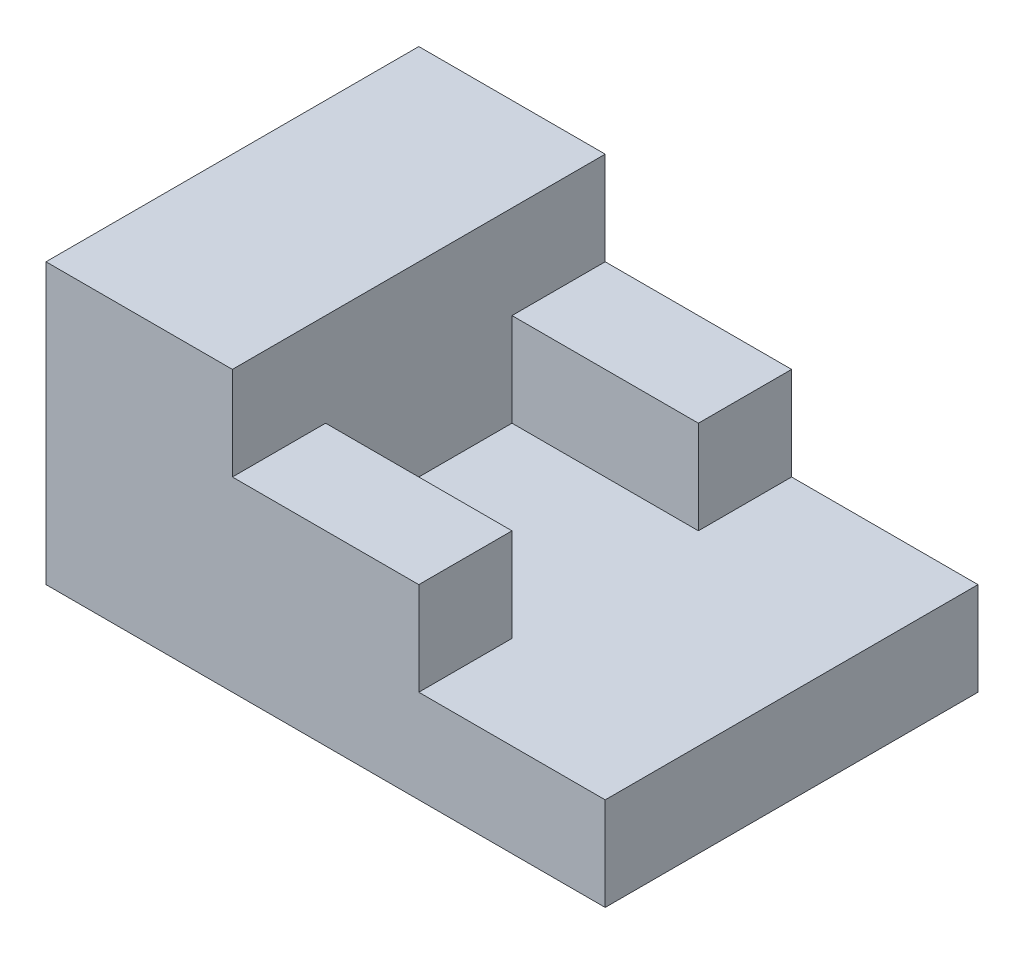
ISO-10303-21;
HEADER;
FILE_DESCRIPTION(('STEP AP214'),'2;1');
FILE_NAME('part.step','',(''),(''),'','','');
FILE_SCHEMA(('AUTOMOTIVE_DESIGN { 1 0 10303 214 1 1 1 1 }'));
ENDSEC;
DATA;
#1=APPLICATION_CONTEXT('core data for automotive mechanical design processes');
#2=APPLICATION_PROTOCOL_DEFINITION('international standard','automotive_design',2000,#1);
#3=PRODUCT_CONTEXT('',#1,'mechanical');
#4=PRODUCT('Part','Part','',(#3));
#5=PRODUCT_RELATED_PRODUCT_CATEGORY('part','',(#4));
#6=PRODUCT_DEFINITION_FORMATION('','',#4);
#7=PRODUCT_DEFINITION_CONTEXT('part definition',#1,'design');
#8=PRODUCT_DEFINITION('design','',#6,#7);
#9=PRODUCT_DEFINITION_SHAPE('','',#8);
#10=(LENGTH_UNIT() NAMED_UNIT(*) SI_UNIT(.MILLI.,.METRE.));
#11=(NAMED_UNIT(*) PLANE_ANGLE_UNIT() SI_UNIT($,.RADIAN.));
#12=(NAMED_UNIT(*) SI_UNIT($,.STERADIAN.) SOLID_ANGLE_UNIT());
#13=UNCERTAINTY_MEASURE_WITH_UNIT(LENGTH_MEASURE(1.E-05),#10,'distance_accuracy_value','');
#14=(GEOMETRIC_REPRESENTATION_CONTEXT(3) GLOBAL_UNCERTAINTY_ASSIGNED_CONTEXT((#13)) GLOBAL_UNIT_ASSIGNED_CONTEXT((#10,
#11,#12)) REPRESENTATION_CONTEXT('',''));
#15=CARTESIAN_POINT('',(0.,0.,0.));
#16=DIRECTION('',(0.,0.,1.));
#17=DIRECTION('',(1.,0.,0.));
#18=AXIS2_PLACEMENT_3D('',#15,#16,#17);
#19=CARTESIAN_POINT('',(-2.90909090909091,6.54545454545455,0.));
#20=DIRECTION('',(0.,1.,0.));
#21=DIRECTION('',(0.,0.,1.));
#22=AXIS2_PLACEMENT_3D('',#19,#20,#21);
#23=PLANE('',#22);
#24=DIRECTION('',(0.,0.,-1.));
#25=VECTOR('',#24,1.);
#26=CARTESIAN_POINT('',(-3.90909090909091,6.54545454545455,0.));
#27=LINE('',#26,#25);
#28=CARTESIAN_POINT('',(-3.90909090909091,6.54545454545455,2.));
#29=VERTEX_POINT('',#28);
#30=CARTESIAN_POINT('',(-3.90909090909091,6.54545454545455,1.));
#31=VERTEX_POINT('',#30);
#32=EDGE_CURVE('E11',#29,#31,#27,.T.);
#33=ORIENTED_EDGE('',*,*,#32,.F.);
#34=DIRECTION('',(1.,0.,0.));
#35=VECTOR('',#34,1.);
#36=CARTESIAN_POINT('',(-2.90909090909091,6.54545454545455,2.));
#37=LINE('',#36,#35);
#38=CARTESIAN_POINT('',(-1.90909090909091,6.54545454545455,2.));
#39=VERTEX_POINT('',#38);
#40=EDGE_CURVE('E168',#29,#39,#37,.T.);
#41=ORIENTED_EDGE('',*,*,#40,.T.);
#42=DIRECTION('',(0.,0.,1.));
#43=VECTOR('',#42,1.);
#44=CARTESIAN_POINT('',(-1.90909090909091,6.54545454545455,0.));
#45=LINE('',#44,#43);
#46=CARTESIAN_POINT('',(-1.90909090909091,6.54545454545455,1.));
#47=VERTEX_POINT('',#46);
#48=EDGE_CURVE('E170',#47,#39,#45,.T.);
#49=ORIENTED_EDGE('',*,*,#48,.F.);
#50=DIRECTION('',(1.,0.,0.));
#51=VECTOR('',#50,1.);
#52=CARTESIAN_POINT('',(-2.90909090909091,6.54545454545455,1.));
#53=LINE('',#52,#51);
#54=EDGE_CURVE('E173',#31,#47,#53,.T.);
#55=ORIENTED_EDGE('',*,*,#54,.F.);
#56=EDGE_LOOP('',(#33,#41,#49,#55));
#57=FACE_BOUND('',#56,.T.);
#58=ADVANCED_FACE('F38',(#57),#23,.T.);
#59=CARTESIAN_POINT('',(-2.90909090909091,5.54545454545455,0.));
#60=DIRECTION('',(0.,1.,0.));
#61=DIRECTION('',(0.,0.,1.));
#62=AXIS2_PLACEMENT_3D('',#59,#60,#61);
#63=PLANE('',#62);
#64=DIRECTION('',(1.,0.,0.));
#65=VECTOR('',#64,1.);
#66=CARTESIAN_POINT('',(-2.90909090909091,5.54545454545455,-2.));
#67=LINE('',#66,#65);
#68=CARTESIAN_POINT('',(-1.90909090909091,5.54545454545455,-2.));
#69=VERTEX_POINT('',#68);
#70=CARTESIAN_POINT('',(0.0909090909090894,5.54545454545455,-2.));
#71=VERTEX_POINT('',#70);
#72=EDGE_CURVE('E139',#69,#71,#67,.T.);
#73=ORIENTED_EDGE('',*,*,#72,.F.);
#74=DIRECTION('',(0.,0.,1.));
#75=VECTOR('',#74,1.);
#76=CARTESIAN_POINT('',(-1.90909090909091,5.54545454545455,0.));
#77=LINE('',#76,#75);
#78=CARTESIAN_POINT('',(-1.90909090909091,5.54545454545455,-1.));
#79=VERTEX_POINT('',#78);
#80=EDGE_CURVE('E59',#69,#79,#77,.T.);
#81=ORIENTED_EDGE('',*,*,#80,.T.);
#82=DIRECTION('',(-1.,0.,0.));
#83=VECTOR('',#82,1.);
#84=CARTESIAN_POINT('',(-2.90909090909091,5.54545454545455,-1.));
#85=LINE('',#84,#83);
#86=CARTESIAN_POINT('',(-3.90909090909091,5.54545454545455,-1.));
#87=VERTEX_POINT('',#86);
#88=EDGE_CURVE('E204',#79,#87,#85,.T.);
#89=ORIENTED_EDGE('',*,*,#88,.T.);
#90=DIRECTION('',(0.,0.,-1.));
#91=VECTOR('',#90,1.);
#92=CARTESIAN_POINT('',(-3.90909090909091,5.54545454545455,0.));
#93=LINE('',#92,#91);
#94=CARTESIAN_POINT('',(-3.90909090909091,5.54545454545455,1.));
#95=VERTEX_POINT('',#94);
#96=EDGE_CURVE('E194',#95,#87,#93,.T.);
#97=ORIENTED_EDGE('',*,*,#96,.F.);
#98=DIRECTION('',(-1.,0.,0.));
#99=VECTOR('',#98,1.);
#100=CARTESIAN_POINT('',(-2.90909090909091,5.54545454545455,1.));
#101=LINE('',#100,#99);
#102=CARTESIAN_POINT('',(-1.90909090909091,5.54545454545455,1.));
#103=VERTEX_POINT('',#102);
#104=EDGE_CURVE('E197',#103,#95,#101,.T.);
#105=ORIENTED_EDGE('',*,*,#104,.F.);
#106=DIRECTION('',(0.,0.,-1.));
#107=VECTOR('',#106,1.);
#108=CARTESIAN_POINT('',(-1.90909090909091,5.54545454545455,0.));
#109=LINE('',#108,#107);
#110=CARTESIAN_POINT('',(-1.90909090909091,5.54545454545455,2.));
#111=VERTEX_POINT('',#110);
#112=EDGE_CURVE('E200',#111,#103,#109,.T.);
#113=ORIENTED_EDGE('',*,*,#112,.F.);
#114=DIRECTION('',(1.,0.,0.));
#115=VECTOR('',#114,1.);
#116=CARTESIAN_POINT('',(-2.90909090909091,5.54545454545455,2.));
#117=LINE('',#116,#115);
#118=CARTESIAN_POINT('',(0.0909090909090894,5.54545454545455,2.));
#119=VERTEX_POINT('',#118);
#120=EDGE_CURVE('E207',#111,#119,#117,.T.);
#121=ORIENTED_EDGE('',*,*,#120,.T.);
#122=DIRECTION('',(0.,0.,-1.));
#123=VECTOR('',#122,1.);
#124=CARTESIAN_POINT('',(0.0909090909090894,5.54545454545455,0.));
#125=LINE('',#124,#123);
#126=EDGE_CURVE('E209',#119,#71,#125,.T.);
#127=ORIENTED_EDGE('',*,*,#126,.T.);
#128=EDGE_LOOP('',(#73,#81,#89,#97,#105,#113,#121,#127));
#129=FACE_BOUND('',#128,.T.);
#130=ADVANCED_FACE('F238',(#129),#63,.T.);
#131=CARTESIAN_POINT('',(-5.90909090909091,5.54545454545455,0.));
#132=DIRECTION('',(-1.,0.,0.));
#133=DIRECTION('',(0.,0.,1.));
#134=AXIS2_PLACEMENT_3D('',#131,#132,#133);
#135=PLANE('',#134);
#136=DIRECTION('',(0.,0.,-1.));
#137=VECTOR('',#136,1.);
#138=CARTESIAN_POINT('',(-5.90909090909091,4.54545454545455,0.));
#139=LINE('',#138,#137);
#140=CARTESIAN_POINT('',(-5.90909090909091,4.54545454545455,2.));
#141=VERTEX_POINT('',#140);
#142=CARTESIAN_POINT('',(-5.90909090909091,4.54545454545455,-2.));
#143=VERTEX_POINT('',#142);
#144=EDGE_CURVE('E206',#141,#143,#139,.T.);
#145=ORIENTED_EDGE('',*,*,#144,.F.);
#146=DIRECTION('',(0.,-1.,0.));
#147=VECTOR('',#146,1.);
#148=CARTESIAN_POINT('',(-5.90909090909091,5.54545454545455,2.));
#149=LINE('',#148,#147);
#150=CARTESIAN_POINT('',(-5.90909090909091,7.54545454545455,2.));
#151=VERTEX_POINT('',#150);
#152=EDGE_CURVE('E148',#151,#141,#149,.T.);
#153=ORIENTED_EDGE('',*,*,#152,.F.);
#154=DIRECTION('',(0.,0.,-1.));
#155=VECTOR('',#154,1.);
#156=CARTESIAN_POINT('',(-5.90909090909091,7.54545454545455,0.));
#157=LINE('',#156,#155);
#158=CARTESIAN_POINT('',(-5.90909090909091,7.54545454545455,-2.));
#159=VERTEX_POINT('',#158);
#160=EDGE_CURVE('E144',#151,#159,#157,.T.);
#161=ORIENTED_EDGE('',*,*,#160,.T.);
#162=DIRECTION('',(0.,-1.,0.));
#163=VECTOR('',#162,1.);
#164=CARTESIAN_POINT('',(-5.90909090909091,5.54545454545455,-2.));
#165=LINE('',#164,#163);
#166=EDGE_CURVE('E126',#159,#143,#165,.T.);
#167=ORIENTED_EDGE('',*,*,#166,.T.);
#168=EDGE_LOOP('',(#145,#153,#161,#167));
#169=FACE_BOUND('',#168,.T.);
#170=ADVANCED_FACE('F40',(#169),#135,.T.);
#171=CARTESIAN_POINT('',(-2.90909090909091,5.54545454545455,2.));
#172=DIRECTION('',(0.,0.,-1.));
#173=DIRECTION('',(-1.,0.,0.));
#174=AXIS2_PLACEMENT_3D('',#171,#172,#173);
#175=PLANE('',#174);
#176=ORIENTED_EDGE('',*,*,#40,.F.);
#177=DIRECTION('',(0.,-1.,0.));
#178=VECTOR('',#177,1.);
#179=CARTESIAN_POINT('',(-3.90909090909091,7.54545454545455,2.));
#180=LINE('',#179,#178);
#181=CARTESIAN_POINT('',(-3.90909090909091,7.54545454545455,2.));
#182=VERTEX_POINT('',#181);
#183=EDGE_CURVE('E157',#182,#29,#180,.T.);
#184=ORIENTED_EDGE('',*,*,#183,.F.);
#185=DIRECTION('',(1.,0.,0.));
#186=VECTOR('',#185,1.);
#187=CARTESIAN_POINT('',(-2.90909090909091,7.54545454545455,2.));
#188=LINE('',#187,#186);
#189=EDGE_CURVE('E150',#151,#182,#188,.T.);
#190=ORIENTED_EDGE('',*,*,#189,.F.);
#191=ORIENTED_EDGE('',*,*,#152,.T.);
#192=DIRECTION('',(1.,0.,0.));
#193=VECTOR('',#192,1.);
#194=CARTESIAN_POINT('',(-2.90909090909091,4.54545454545455,2.));
#195=LINE('',#194,#193);
#196=CARTESIAN_POINT('',(0.0909090909090894,4.54545454545455,2.));
#197=VERTEX_POINT('',#196);
#198=EDGE_CURVE('E214',#141,#197,#195,.T.);
#199=ORIENTED_EDGE('',*,*,#198,.T.);
#200=DIRECTION('',(0.,-1.,0.));
#201=VECTOR('',#200,1.);
#202=CARTESIAN_POINT('',(0.0909090909090894,5.54545454545455,2.));
#203=LINE('',#202,#201);
#204=EDGE_CURVE('E221',#119,#197,#203,.T.);
#205=ORIENTED_EDGE('',*,*,#204,.F.);
#206=ORIENTED_EDGE('',*,*,#120,.F.);
#207=DIRECTION('',(0.,-1.,0.));
#208=VECTOR('',#207,1.);
#209=CARTESIAN_POINT('',(-1.90909090909091,6.54545454545455,2.));
#210=LINE('',#209,#208);
#211=EDGE_CURVE('E185',#39,#111,#210,.T.);
#212=ORIENTED_EDGE('',*,*,#211,.F.);
#213=EDGE_LOOP('',(#176,#184,#190,#191,#199,#205,#206,#212));
#214=FACE_BOUND('',#213,.T.);
#215=ADVANCED_FACE('F247',(#214),#175,.F.);
#216=CARTESIAN_POINT('',(0.0909090909090894,5.54545454545455,0.));
#217=DIRECTION('',(-1.,0.,0.));
#218=DIRECTION('',(0.,0.,1.));
#219=AXIS2_PLACEMENT_3D('',#216,#217,#218);
#220=PLANE('',#219);
#221=DIRECTION('',(0.,0.,-1.));
#222=VECTOR('',#221,1.);
#223=CARTESIAN_POINT('',(0.0909090909090894,4.54545454545455,0.));
#224=LINE('',#223,#222);
#225=CARTESIAN_POINT('',(0.0909090909090894,4.54545454545455,-2.));
#226=VERTEX_POINT('',#225);
#227=EDGE_CURVE('E216',#197,#226,#224,.T.);
#228=ORIENTED_EDGE('',*,*,#227,.T.);
#229=DIRECTION('',(0.,-1.,0.));
#230=VECTOR('',#229,1.);
#231=CARTESIAN_POINT('',(0.0909090909090894,5.54545454545455,-2.));
#232=LINE('',#231,#230);
#233=EDGE_CURVE('E138',#71,#226,#232,.T.);
#234=ORIENTED_EDGE('',*,*,#233,.F.);
#235=ORIENTED_EDGE('',*,*,#126,.F.);
#236=ORIENTED_EDGE('',*,*,#204,.T.);
#237=EDGE_LOOP('',(#228,#234,#235,#236));
#238=FACE_BOUND('',#237,.T.);
#239=ADVANCED_FACE('F252',(#238),#220,.F.);
#240=CARTESIAN_POINT('',(-2.90909090909091,5.54545454545455,-2.));
#241=DIRECTION('',(0.,0.,-1.));
#242=DIRECTION('',(-1.,0.,0.));
#243=AXIS2_PLACEMENT_3D('',#240,#241,#242);
#244=PLANE('',#243);
#245=ORIENTED_EDGE('',*,*,#233,.T.);
#246=DIRECTION('',(1.,0.,0.));
#247=VECTOR('',#246,1.);
#248=CARTESIAN_POINT('',(-2.90909090909091,4.54545454545455,-2.));
#249=LINE('',#248,#247);
#250=EDGE_CURVE('E133',#143,#226,#249,.T.);
#251=ORIENTED_EDGE('',*,*,#250,.F.);
#252=ORIENTED_EDGE('',*,*,#166,.F.);
#253=DIRECTION('',(1.,0.,0.));
#254=VECTOR('',#253,1.);
#255=CARTESIAN_POINT('',(-2.90909090909091,7.54545454545455,-2.));
#256=LINE('',#255,#254);
#257=CARTESIAN_POINT('',(-3.90909090909091,7.54545454545455,-2.));
#258=VERTEX_POINT('',#257);
#259=EDGE_CURVE('E131',#159,#258,#256,.T.);
#260=ORIENTED_EDGE('',*,*,#259,.T.);
#261=DIRECTION('',(0.,-1.,0.));
#262=VECTOR('',#261,1.);
#263=CARTESIAN_POINT('',(-3.90909090909091,7.54545454545455,-2.));
#264=LINE('',#263,#262);
#265=CARTESIAN_POINT('',(-3.90909090909091,6.54545454545455,-2.));
#266=VERTEX_POINT('',#265);
#267=EDGE_CURVE('E155',#258,#266,#264,.T.);
#268=ORIENTED_EDGE('',*,*,#267,.T.);
#269=DIRECTION('',(1.,0.,0.));
#270=VECTOR('',#269,1.);
#271=CARTESIAN_POINT('',(-2.90909090909091,6.54545454545455,-2.));
#272=LINE('',#271,#270);
#273=CARTESIAN_POINT('',(-1.90909090909091,6.54545454545455,-2.));
#274=VERTEX_POINT('',#273);
#275=EDGE_CURVE('E166',#266,#274,#272,.T.);
#276=ORIENTED_EDGE('',*,*,#275,.T.);
#277=DIRECTION('',(0.,-1.,0.));
#278=VECTOR('',#277,1.);
#279=CARTESIAN_POINT('',(-1.90909090909091,6.54545454545455,-2.));
#280=LINE('',#279,#278);
#281=EDGE_CURVE('E188',#274,#69,#280,.T.);
#282=ORIENTED_EDGE('',*,*,#281,.T.);
#283=ORIENTED_EDGE('',*,*,#72,.T.);
#284=EDGE_LOOP('',(#245,#251,#252,#260,#268,#276,#282,#283));
#285=FACE_BOUND('',#284,.T.);
#286=ADVANCED_FACE('F129',(#285),#244,.T.);
#287=CARTESIAN_POINT('',(-2.90909090909091,4.54545454545455,0.));
#288=DIRECTION('',(0.,1.,0.));
#289=DIRECTION('',(0.,0.,1.));
#290=AXIS2_PLACEMENT_3D('',#287,#288,#289);
#291=PLANE('',#290);
#292=ORIENTED_EDGE('',*,*,#227,.F.);
#293=ORIENTED_EDGE('',*,*,#198,.F.);
#294=ORIENTED_EDGE('',*,*,#144,.T.);
#295=ORIENTED_EDGE('',*,*,#250,.T.);
#296=EDGE_LOOP('',(#292,#293,#294,#295));
#297=FACE_BOUND('',#296,.T.);
#298=ADVANCED_FACE('F254',(#297),#291,.F.);
#299=CARTESIAN_POINT('',(-2.90909090909091,6.54545454545455,-1.));
#300=DIRECTION('',(0.,0.,-1.));
#301=DIRECTION('',(-1.,0.,0.));
#302=AXIS2_PLACEMENT_3D('',#299,#300,#301);
#303=PLANE('',#302);
#304=ORIENTED_EDGE('',*,*,#88,.F.);
#305=DIRECTION('',(0.,-1.,0.));
#306=VECTOR('',#305,1.);
#307=CARTESIAN_POINT('',(-1.90909090909091,6.54545454545455,-1.));
#308=LINE('',#307,#306);
#309=CARTESIAN_POINT('',(-1.90909090909091,6.54545454545455,-1.));
#310=VERTEX_POINT('',#309);
#311=EDGE_CURVE('E191',#310,#79,#308,.T.);
#312=ORIENTED_EDGE('',*,*,#311,.F.);
#313=DIRECTION('',(1.,0.,0.));
#314=VECTOR('',#313,1.);
#315=CARTESIAN_POINT('',(-2.90909090909091,6.54545454545455,-1.));
#316=LINE('',#315,#314);
#317=CARTESIAN_POINT('',(-3.90909090909091,6.54545454545455,-1.));
#318=VERTEX_POINT('',#317);
#319=EDGE_CURVE('E160',#318,#310,#316,.T.);
#320=ORIENTED_EDGE('',*,*,#319,.F.);
#321=DIRECTION('',(0.,-1.,0.));
#322=VECTOR('',#321,1.);
#323=CARTESIAN_POINT('',(-3.90909090909091,6.54545454545455,-1.));
#324=LINE('',#323,#322);
#325=EDGE_CURVE('E176',#318,#87,#324,.T.);
#326=ORIENTED_EDGE('',*,*,#325,.T.);
#327=EDGE_LOOP('',(#304,#312,#320,#326));
#328=FACE_BOUND('',#327,.T.);
#329=ADVANCED_FACE('F237',(#328),#303,.F.);
#330=CARTESIAN_POINT('',(-1.90909090909091,6.54545454545455,0.));
#331=DIRECTION('',(-1.,0.,0.));
#332=DIRECTION('',(0.,0.,1.));
#333=AXIS2_PLACEMENT_3D('',#330,#331,#332);
#334=PLANE('',#333);
#335=ORIENTED_EDGE('',*,*,#80,.F.);
#336=ORIENTED_EDGE('',*,*,#281,.F.);
#337=DIRECTION('',(0.,0.,-1.));
#338=VECTOR('',#337,1.);
#339=CARTESIAN_POINT('',(-1.90909090909091,6.54545454545455,0.));
#340=LINE('',#339,#338);
#341=EDGE_CURVE('E163',#310,#274,#340,.T.);
#342=ORIENTED_EDGE('',*,*,#341,.F.);
#343=ORIENTED_EDGE('',*,*,#311,.T.);
#344=EDGE_LOOP('',(#335,#336,#342,#343));
#345=FACE_BOUND('',#344,.T.);
#346=ADVANCED_FACE('F235',(#345),#334,.F.);
#347=CARTESIAN_POINT('',(-1.90909090909091,6.54545454545455,0.));
#348=DIRECTION('',(1.,0.,0.));
#349=DIRECTION('',(0.,0.,-1.));
#350=AXIS2_PLACEMENT_3D('',#347,#348,#349);
#351=PLANE('',#350);
#352=ORIENTED_EDGE('',*,*,#211,.T.);
#353=ORIENTED_EDGE('',*,*,#112,.T.);
#354=DIRECTION('',(0.,-1.,0.));
#355=VECTOR('',#354,1.);
#356=CARTESIAN_POINT('',(-1.90909090909091,6.54545454545455,1.));
#357=LINE('',#356,#355);
#358=EDGE_CURVE('E182',#47,#103,#357,.T.);
#359=ORIENTED_EDGE('',*,*,#358,.F.);
#360=ORIENTED_EDGE('',*,*,#48,.T.);
#361=EDGE_LOOP('',(#352,#353,#359,#360));
#362=FACE_BOUND('',#361,.T.);
#363=ADVANCED_FACE('F244',(#362),#351,.T.);
#364=CARTESIAN_POINT('',(-2.90909090909091,6.54545454545455,1.));
#365=DIRECTION('',(0.,0.,-1.));
#366=DIRECTION('',(-1.,0.,0.));
#367=AXIS2_PLACEMENT_3D('',#364,#365,#366);
#368=PLANE('',#367);
#369=ORIENTED_EDGE('',*,*,#358,.T.);
#370=ORIENTED_EDGE('',*,*,#104,.T.);
#371=DIRECTION('',(0.,-1.,0.));
#372=VECTOR('',#371,1.);
#373=CARTESIAN_POINT('',(-3.90909090909091,6.54545454545455,1.));
#374=LINE('',#373,#372);
#375=EDGE_CURVE('E179',#31,#95,#374,.T.);
#376=ORIENTED_EDGE('',*,*,#375,.F.);
#377=ORIENTED_EDGE('',*,*,#54,.T.);
#378=EDGE_LOOP('',(#369,#370,#376,#377));
#379=FACE_BOUND('',#378,.T.);
#380=ADVANCED_FACE('F240',(#379),#368,.T.);
#381=CARTESIAN_POINT('',(-3.90909090909091,6.54545454545455,0.));
#382=DIRECTION('',(1.,0.,0.));
#383=DIRECTION('',(0.,0.,-1.));
#384=AXIS2_PLACEMENT_3D('',#381,#382,#383);
#385=PLANE('',#384);
#386=ORIENTED_EDGE('',*,*,#375,.T.);
#387=ORIENTED_EDGE('',*,*,#96,.T.);
#388=ORIENTED_EDGE('',*,*,#325,.F.);
#389=EDGE_CURVE('E42',#318,#266,#27,.T.);
#390=ORIENTED_EDGE('',*,*,#389,.T.);
#391=ORIENTED_EDGE('',*,*,#267,.F.);
#392=DIRECTION('',(0.,0.,1.));
#393=VECTOR('',#392,1.);
#394=CARTESIAN_POINT('',(-3.90909090909091,7.54545454545455,0.));
#395=LINE('',#394,#393);
#396=EDGE_CURVE('E146',#258,#182,#395,.T.);
#397=ORIENTED_EDGE('',*,*,#396,.T.);
#398=ORIENTED_EDGE('',*,*,#183,.T.);
#399=ORIENTED_EDGE('',*,*,#32,.T.);
#400=EDGE_LOOP('',(#386,#387,#388,#390,#391,#397,#398,#399));
#401=FACE_BOUND('',#400,.T.);
#402=ADVANCED_FACE('F228',(#401),#385,.T.);
#403=ORIENTED_EDGE('',*,*,#389,.F.);
#404=ORIENTED_EDGE('',*,*,#319,.T.);
#405=ORIENTED_EDGE('',*,*,#341,.T.);
#406=ORIENTED_EDGE('',*,*,#275,.F.);
#407=EDGE_LOOP('',(#403,#404,#405,#406));
#408=FACE_BOUND('',#407,.T.);
#409=ADVANCED_FACE('F232',(#408),#23,.T.);
#410=CARTESIAN_POINT('',(-2.90909090909091,7.54545454545455,0.));
#411=DIRECTION('',(0.,1.,0.));
#412=DIRECTION('',(0.,0.,1.));
#413=AXIS2_PLACEMENT_3D('',#410,#411,#412);
#414=PLANE('',#413);
#415=ORIENTED_EDGE('',*,*,#259,.F.);
#416=ORIENTED_EDGE('',*,*,#160,.F.);
#417=ORIENTED_EDGE('',*,*,#189,.T.);
#418=ORIENTED_EDGE('',*,*,#396,.F.);
#419=EDGE_LOOP('',(#415,#416,#417,#418));
#420=FACE_BOUND('',#419,.T.);
#421=ADVANCED_FACE('F143',(#420),#414,.T.);
#422=CLOSED_SHELL('',(#58,#130,#170,#215,#239,#286,#298,#329,#346,#363,#380,#402,#409,#421));
#423=MANIFOLD_SOLID_BREP('B2',#422);
#424=ADVANCED_BREP_SHAPE_REPRESENTATION('',(#18,#423),#14);
#425=SHAPE_DEFINITION_REPRESENTATION(#9,#424);
ENDSEC;
END-ISO-10303-21;
